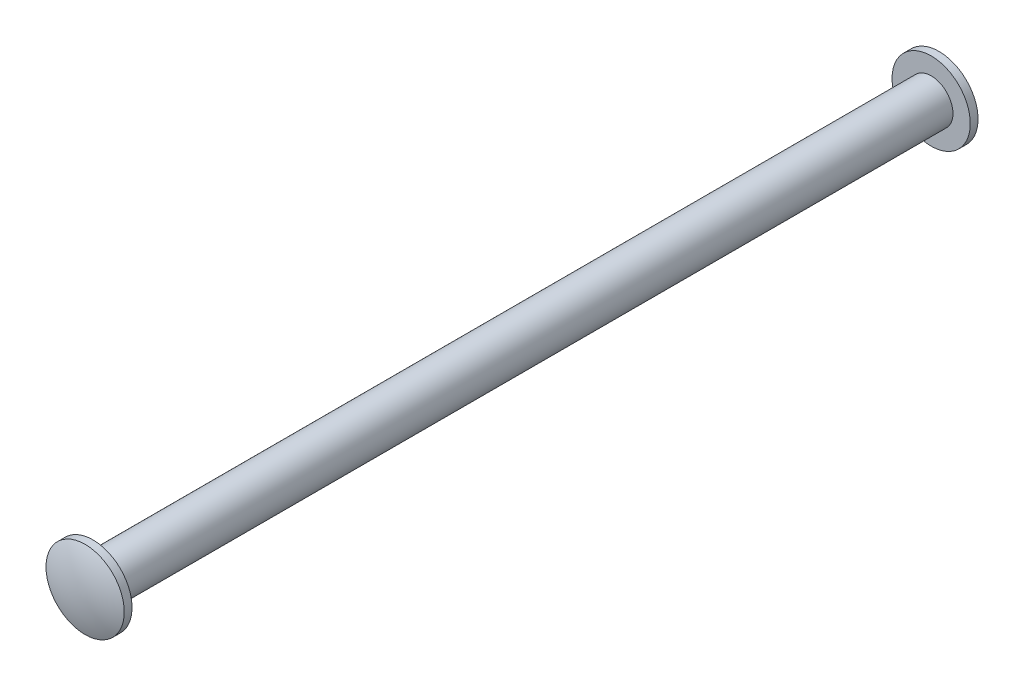
ISO-10303-21;
HEADER;
FILE_DESCRIPTION(('STEP AP214'),'2;1');
FILE_NAME('part.step','',(''),(''),'','','');
FILE_SCHEMA(('AUTOMOTIVE_DESIGN { 1 0 10303 214 1 1 1 1 }'));
ENDSEC;
DATA;
#1=APPLICATION_CONTEXT('core data for automotive mechanical design processes');
#2=APPLICATION_PROTOCOL_DEFINITION('international standard','automotive_design',2000,#1);
#3=PRODUCT_CONTEXT('',#1,'mechanical');
#4=PRODUCT('Part','Part','',(#3));
#5=PRODUCT_RELATED_PRODUCT_CATEGORY('part','',(#4));
#6=PRODUCT_DEFINITION_FORMATION('','',#4);
#7=PRODUCT_DEFINITION_CONTEXT('part definition',#1,'design');
#8=PRODUCT_DEFINITION('design','',#6,#7);
#9=PRODUCT_DEFINITION_SHAPE('','',#8);
#10=(LENGTH_UNIT() NAMED_UNIT(*) SI_UNIT(.MILLI.,.METRE.));
#11=(NAMED_UNIT(*) PLANE_ANGLE_UNIT() SI_UNIT($,.RADIAN.));
#12=(NAMED_UNIT(*) SI_UNIT($,.STERADIAN.) SOLID_ANGLE_UNIT());
#13=UNCERTAINTY_MEASURE_WITH_UNIT(LENGTH_MEASURE(1.E-05),#10,'distance_accuracy_value','');
#14=(GEOMETRIC_REPRESENTATION_CONTEXT(3) GLOBAL_UNCERTAINTY_ASSIGNED_CONTEXT((#13)) GLOBAL_UNIT_ASSIGNED_CONTEXT((#10,
#11,#12)) REPRESENTATION_CONTEXT('',''));
#15=CARTESIAN_POINT('',(0.,0.,0.));
#16=DIRECTION('',(0.,0.,1.));
#17=DIRECTION('',(1.,0.,0.));
#18=AXIS2_PLACEMENT_3D('',#15,#16,#17);
#19=CARTESIAN_POINT('',(0.,0.,30.2411262007169));
#20=DIRECTION('',(0.,0.,-1.));
#21=DIRECTION('',(1.,0.,0.));
#22=AXIS2_PLACEMENT_3D('',#19,#20,#21);
#23=SPHERICAL_SURFACE('',#22,9.27619379928307);
#24=CARTESIAN_POINT('',(0.,0.,38.80866));
#25=DIRECTION('',(0.,0.,-1.));
#26=DIRECTION('',(-1.,0.,0.));
#27=AXIS2_PLACEMENT_3D('',#24,#25,#26);
#28=CIRCLE('',#27,3.556);
#29=CARTESIAN_POINT('',(-3.556,0.,38.80866));
#30=VERTEX_POINT('',#29);
#31=EDGE_CURVE('E53',#30,#30,#28,.T.);
#32=ORIENTED_EDGE('',*,*,#31,.F.);
#33=EDGE_LOOP('',(#32));
#34=FACE_BOUND('',#33,.T.);
#35=ADVANCED_FACE('F31',(#34),#23,.T.);
#36=CARTESIAN_POINT('',(0.,0.,-30.2411262007169));
#37=DIRECTION('',(0.,0.,-1.));
#38=DIRECTION('',(-1.,0.,0.));
#39=AXIS2_PLACEMENT_3D('',#36,#37,#38);
#40=SPHERICAL_SURFACE('',#39,9.27619379928307);
#41=CARTESIAN_POINT('',(0.,0.,-38.80866));
#42=DIRECTION('',(0.,0.,-1.));
#43=DIRECTION('',(-1.,0.,0.));
#44=AXIS2_PLACEMENT_3D('',#41,#42,#43);
#45=CIRCLE('',#44,3.556);
#46=CARTESIAN_POINT('',(-3.556,0.,-38.80866));
#47=VERTEX_POINT('',#46);
#48=EDGE_CURVE('E10',#47,#47,#45,.T.);
#49=ORIENTED_EDGE('',*,*,#48,.T.);
#50=EDGE_LOOP('',(#49));
#51=FACE_BOUND('',#50,.T.);
#52=ADVANCED_FACE('F61',(#51),#40,.T.);
#53=CARTESIAN_POINT('',(0.,0.,39.51732));
#54=DIRECTION('',(0.,0.,-1.));
#55=DIRECTION('',(-1.,0.,0.));
#56=AXIS2_PLACEMENT_3D('',#53,#54,#55);
#57=CYLINDRICAL_SURFACE('',#56,3.556);
#58=CARTESIAN_POINT('',(0.,0.,-38.1));
#59=DIRECTION('',(0.,0.,-1.));
#60=DIRECTION('',(-1.,0.,0.));
#61=AXIS2_PLACEMENT_3D('',#58,#59,#60);
#62=CIRCLE('',#61,3.556);
#63=CARTESIAN_POINT('',(-3.556,0.,-38.1));
#64=VERTEX_POINT('',#63);
#65=EDGE_CURVE('E37',#64,#64,#62,.T.);
#66=ORIENTED_EDGE('',*,*,#65,.T.);
#67=EDGE_LOOP('',(#66));
#68=FACE_BOUND('',#67,.T.);
#69=ORIENTED_EDGE('',*,*,#48,.F.);
#70=EDGE_LOOP('',(#69));
#71=FACE_BOUND('',#70,.T.);
#72=ADVANCED_FACE('F65',(#68,#71),#57,.T.);
#73=CARTESIAN_POINT('',(3.556,0.,-38.1));
#74=DIRECTION('',(0.,0.,1.));
#75=DIRECTION('',(1.,0.,0.));
#76=AXIS2_PLACEMENT_3D('',#73,#74,#75);
#77=PLANE('',#76);
#78=CARTESIAN_POINT('',(0.,0.,-38.1));
#79=DIRECTION('',(0.,0.,-1.));
#80=DIRECTION('',(-1.,0.,0.));
#81=AXIS2_PLACEMENT_3D('',#78,#79,#80);
#82=CIRCLE('',#81,1.984375);
#83=CARTESIAN_POINT('',(-1.984375,0.,-38.1));
#84=VERTEX_POINT('',#83);
#85=EDGE_CURVE('E41',#84,#84,#82,.T.);
#86=ORIENTED_EDGE('',*,*,#85,.T.);
#87=EDGE_LOOP('',(#86));
#88=FACE_BOUND('',#87,.T.);
#89=ORIENTED_EDGE('',*,*,#65,.F.);
#90=EDGE_LOOP('',(#89));
#91=FACE_BOUND('',#90,.T.);
#92=ADVANCED_FACE('F69',(#88,#91),#77,.T.);
#93=CARTESIAN_POINT('',(0.,0.,39.51732));
#94=DIRECTION('',(0.,0.,-1.));
#95=DIRECTION('',(-1.,0.,0.));
#96=AXIS2_PLACEMENT_3D('',#93,#94,#95);
#97=CYLINDRICAL_SURFACE('',#96,1.984375);
#98=CARTESIAN_POINT('',(0.,0.,38.1));
#99=DIRECTION('',(0.,0.,-1.));
#100=DIRECTION('',(-1.,0.,0.));
#101=AXIS2_PLACEMENT_3D('',#98,#99,#100);
#102=CIRCLE('',#101,1.984375);
#103=CARTESIAN_POINT('',(-1.984375,0.,38.1));
#104=VERTEX_POINT('',#103);
#105=EDGE_CURVE('E45',#104,#104,#102,.T.);
#106=ORIENTED_EDGE('',*,*,#105,.T.);
#107=EDGE_LOOP('',(#106));
#108=FACE_BOUND('',#107,.T.);
#109=ORIENTED_EDGE('',*,*,#85,.F.);
#110=EDGE_LOOP('',(#109));
#111=FACE_BOUND('',#110,.T.);
#112=ADVANCED_FACE('F74',(#108,#111),#97,.T.);
#113=CARTESIAN_POINT('',(1.984375,0.,38.1));
#114=DIRECTION('',(0.,0.,-1.));
#115=DIRECTION('',(-1.,0.,0.));
#116=AXIS2_PLACEMENT_3D('',#113,#114,#115);
#117=PLANE('',#116);
#118=CARTESIAN_POINT('',(0.,0.,38.1));
#119=DIRECTION('',(0.,0.,-1.));
#120=DIRECTION('',(-1.,0.,0.));
#121=AXIS2_PLACEMENT_3D('',#118,#119,#120);
#122=CIRCLE('',#121,3.556);
#123=CARTESIAN_POINT('',(-3.556,0.,38.1));
#124=VERTEX_POINT('',#123);
#125=EDGE_CURVE('E50',#124,#124,#122,.T.);
#126=ORIENTED_EDGE('',*,*,#125,.T.);
#127=EDGE_LOOP('',(#126));
#128=FACE_BOUND('',#127,.T.);
#129=ORIENTED_EDGE('',*,*,#105,.F.);
#130=EDGE_LOOP('',(#129));
#131=FACE_BOUND('',#130,.T.);
#132=ADVANCED_FACE('F78',(#128,#131),#117,.T.);
#133=CARTESIAN_POINT('',(0.,0.,39.51732));
#134=DIRECTION('',(0.,0.,-1.));
#135=DIRECTION('',(-1.,0.,0.));
#136=AXIS2_PLACEMENT_3D('',#133,#134,#135);
#137=CYLINDRICAL_SURFACE('',#136,3.556);
#138=ORIENTED_EDGE('',*,*,#31,.T.);
#139=EDGE_LOOP('',(#138));
#140=FACE_BOUND('',#139,.T.);
#141=ORIENTED_EDGE('',*,*,#125,.F.);
#142=EDGE_LOOP('',(#141));
#143=FACE_BOUND('',#142,.T.);
#144=ADVANCED_FACE('F57',(#140,#143),#137,.T.);
#145=CLOSED_SHELL('',(#35,#52,#72,#92,#112,#132,#144));
#146=MANIFOLD_SOLID_BREP('B2',#145);
#147=ADVANCED_BREP_SHAPE_REPRESENTATION('',(#18,#146),#14);
#148=SHAPE_DEFINITION_REPRESENTATION(#9,#147);
ENDSEC;
END-ISO-10303-21;
